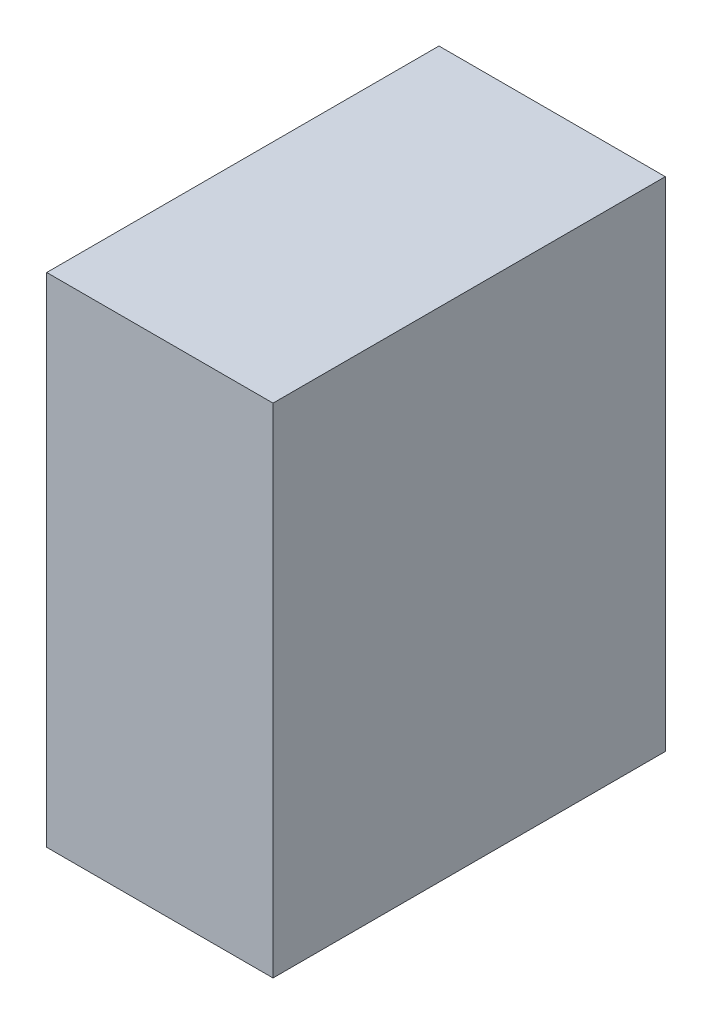
ISO-10303-21;
HEADER;
FILE_DESCRIPTION(('STEP AP214'),'2;1');
FILE_NAME('part.step','',(''),(''),'','','');
FILE_SCHEMA(('AUTOMOTIVE_DESIGN { 1 0 10303 214 1 1 1 1 }'));
ENDSEC;
DATA;
#1=APPLICATION_CONTEXT('core data for automotive mechanical design processes');
#2=APPLICATION_PROTOCOL_DEFINITION('international standard','automotive_design',2000,#1);
#3=PRODUCT_CONTEXT('',#1,'mechanical');
#4=PRODUCT('Part','Part','',(#3));
#5=PRODUCT_RELATED_PRODUCT_CATEGORY('part','',(#4));
#6=PRODUCT_DEFINITION_FORMATION('','',#4);
#7=PRODUCT_DEFINITION_CONTEXT('part definition',#1,'design');
#8=PRODUCT_DEFINITION('design','',#6,#7);
#9=PRODUCT_DEFINITION_SHAPE('','',#8);
#10=(LENGTH_UNIT() NAMED_UNIT(*) SI_UNIT(.MILLI.,.METRE.));
#11=(NAMED_UNIT(*) PLANE_ANGLE_UNIT() SI_UNIT($,.RADIAN.));
#12=(NAMED_UNIT(*) SI_UNIT($,.STERADIAN.) SOLID_ANGLE_UNIT());
#13=UNCERTAINTY_MEASURE_WITH_UNIT(LENGTH_MEASURE(1.E-05),#10,'distance_accuracy_value','');
#14=(GEOMETRIC_REPRESENTATION_CONTEXT(3) GLOBAL_UNCERTAINTY_ASSIGNED_CONTEXT((#13)) GLOBAL_UNIT_ASSIGNED_CONTEXT((#10,
#11,#12)) REPRESENTATION_CONTEXT('',''));
#15=CARTESIAN_POINT('',(0.,0.,0.));
#16=DIRECTION('',(0.,0.,1.));
#17=DIRECTION('',(1.,0.,0.));
#18=AXIS2_PLACEMENT_3D('',#15,#16,#17);
#19=CARTESIAN_POINT('',(0.07500111999998,-0.1649984,0.));
#20=DIRECTION('',(-1.,0.,0.));
#21=DIRECTION('',(0.,1.,0.));
#22=AXIS2_PLACEMENT_3D('',#19,#20,#21);
#23=PLANE('',#22);
#24=DIRECTION('',(0.,1.,0.));
#25=VECTOR('',#24,1.);
#26=CARTESIAN_POINT('',(0.07500111999998,-0.1649984,0.));
#27=LINE('',#26,#25);
#28=CARTESIAN_POINT('',(0.07500111999998,-0.1649984,0.));
#29=VERTEX_POINT('',#28);
#30=CARTESIAN_POINT('',(0.07500111999998,0.16500094,0.));
#31=VERTEX_POINT('',#30);
#32=EDGE_CURVE('E11',#29,#31,#27,.T.);
#33=ORIENTED_EDGE('',*,*,#32,.T.);
#34=DIRECTION('',(0.,0.,1.));
#35=VECTOR('',#34,1.);
#36=CARTESIAN_POINT('',(0.07500111999998,0.16500094,0.));
#37=LINE('',#36,#35);
#38=CARTESIAN_POINT('',(0.07500111999998,0.16500094,0.25999948));
#39=VERTEX_POINT('',#38);
#40=EDGE_CURVE('E24',#31,#39,#37,.T.);
#41=ORIENTED_EDGE('',*,*,#40,.T.);
#42=DIRECTION('',(0.,1.,0.));
#43=VECTOR('',#42,1.);
#44=CARTESIAN_POINT('',(0.07500111999998,-0.1649984,0.25999948));
#45=LINE('',#44,#43);
#46=CARTESIAN_POINT('',(0.07500111999998,-0.1649984,0.25999948));
#47=VERTEX_POINT('',#46);
#48=EDGE_CURVE('E87',#47,#39,#45,.T.);
#49=ORIENTED_EDGE('',*,*,#48,.F.);
#50=DIRECTION('',(0.,0.,1.));
#51=VECTOR('',#50,1.);
#52=CARTESIAN_POINT('',(0.07500111999998,-0.1649984,0.));
#53=LINE('',#52,#51);
#54=EDGE_CURVE('E36',#29,#47,#53,.T.);
#55=ORIENTED_EDGE('',*,*,#54,.F.);
#56=EDGE_LOOP('',(#33,#41,#49,#55));
#57=FACE_BOUND('',#56,.T.);
#58=ADVANCED_FACE('F17',(#57),#23,.F.);
#59=CARTESIAN_POINT('',(0.07500111999998,0.16500094,0.));
#60=DIRECTION('',(0.,-1.,0.));
#61=DIRECTION('',(-1.,0.,0.));
#62=AXIS2_PLACEMENT_3D('',#59,#60,#61);
#63=PLANE('',#62);
#64=DIRECTION('',(-1.,0.,0.));
#65=VECTOR('',#64,1.);
#66=CARTESIAN_POINT('',(0.07500111999998,0.16500094,0.));
#67=LINE('',#66,#65);
#68=CARTESIAN_POINT('',(-0.07499858000001,0.16500094,0.));
#69=VERTEX_POINT('',#68);
#70=EDGE_CURVE('E84',#31,#69,#67,.T.);
#71=ORIENTED_EDGE('',*,*,#70,.T.);
#72=DIRECTION('',(0.,0.,1.));
#73=VECTOR('',#72,1.);
#74=CARTESIAN_POINT('',(-0.07499858000001,0.16500094,0.));
#75=LINE('',#74,#73);
#76=CARTESIAN_POINT('',(-0.07499858000001,0.16500094,0.25999948));
#77=VERTEX_POINT('',#76);
#78=EDGE_CURVE('E82',#69,#77,#75,.T.);
#79=ORIENTED_EDGE('',*,*,#78,.T.);
#80=DIRECTION('',(-1.,0.,0.));
#81=VECTOR('',#80,1.);
#82=CARTESIAN_POINT('',(0.07500111999998,0.16500094,0.25999948));
#83=LINE('',#82,#81);
#84=EDGE_CURVE('E62',#39,#77,#83,.T.);
#85=ORIENTED_EDGE('',*,*,#84,.F.);
#86=ORIENTED_EDGE('',*,*,#40,.F.);
#87=EDGE_LOOP('',(#71,#79,#85,#86));
#88=FACE_BOUND('',#87,.T.);
#89=ADVANCED_FACE('F89',(#88),#63,.F.);
#90=CARTESIAN_POINT('',(-0.07499858000001,0.16500094,0.));
#91=DIRECTION('',(1.,0.,0.));
#92=DIRECTION('',(0.,-1.,0.));
#93=AXIS2_PLACEMENT_3D('',#90,#91,#92);
#94=PLANE('',#93);
#95=DIRECTION('',(0.,-1.,0.));
#96=VECTOR('',#95,1.);
#97=CARTESIAN_POINT('',(-0.07499858000001,0.16500094,0.));
#98=LINE('',#97,#96);
#99=CARTESIAN_POINT('',(-0.07499858000001,-0.1649984,0.));
#100=VERTEX_POINT('',#99);
#101=EDGE_CURVE('E71',#69,#100,#98,.T.);
#102=ORIENTED_EDGE('',*,*,#101,.T.);
#103=DIRECTION('',(0.,0.,1.));
#104=VECTOR('',#103,1.);
#105=CARTESIAN_POINT('',(-0.07499858000001,-0.1649984,0.));
#106=LINE('',#105,#104);
#107=CARTESIAN_POINT('',(-0.07499858000001,-0.1649984,0.25999948));
#108=VERTEX_POINT('',#107);
#109=EDGE_CURVE('E65',#100,#108,#106,.T.);
#110=ORIENTED_EDGE('',*,*,#109,.T.);
#111=DIRECTION('',(0.,-1.,0.));
#112=VECTOR('',#111,1.);
#113=CARTESIAN_POINT('',(-0.07499858000001,0.16500094,0.25999948));
#114=LINE('',#113,#112);
#115=EDGE_CURVE('E57',#77,#108,#114,.T.);
#116=ORIENTED_EDGE('',*,*,#115,.F.);
#117=ORIENTED_EDGE('',*,*,#78,.F.);
#118=EDGE_LOOP('',(#102,#110,#116,#117));
#119=FACE_BOUND('',#118,.T.);
#120=ADVANCED_FACE('F69',(#119),#94,.F.);
#121=CARTESIAN_POINT('',(-0.07499858000001,-0.1649984,0.));
#122=DIRECTION('',(0.,1.,0.));
#123=DIRECTION('',(1.,0.,0.));
#124=AXIS2_PLACEMENT_3D('',#121,#122,#123);
#125=PLANE('',#124);
#126=DIRECTION('',(1.,0.,0.));
#127=VECTOR('',#126,1.);
#128=CARTESIAN_POINT('',(-0.07499858000001,-0.1649984,0.));
#129=LINE('',#128,#127);
#130=EDGE_CURVE('E66',#100,#29,#129,.T.);
#131=ORIENTED_EDGE('',*,*,#130,.T.);
#132=ORIENTED_EDGE('',*,*,#54,.T.);
#133=DIRECTION('',(1.,0.,0.));
#134=VECTOR('',#133,1.);
#135=CARTESIAN_POINT('',(-0.07499858000001,-0.1649984,0.25999948));
#136=LINE('',#135,#134);
#137=EDGE_CURVE('E61',#108,#47,#136,.T.);
#138=ORIENTED_EDGE('',*,*,#137,.F.);
#139=ORIENTED_EDGE('',*,*,#109,.F.);
#140=EDGE_LOOP('',(#131,#132,#138,#139));
#141=FACE_BOUND('',#140,.T.);
#142=ADVANCED_FACE('F76',(#141),#125,.F.);
#143=CARTESIAN_POINT('',(1.269999984288E-06,1.270000002056E-06,0.));
#144=DIRECTION('',(0.,0.,1.));
#145=DIRECTION('',(1.,0.,0.));
#146=AXIS2_PLACEMENT_3D('',#143,#144,#145);
#147=PLANE('',#146);
#148=ORIENTED_EDGE('',*,*,#130,.F.);
#149=ORIENTED_EDGE('',*,*,#101,.F.);
#150=ORIENTED_EDGE('',*,*,#70,.F.);
#151=ORIENTED_EDGE('',*,*,#32,.F.);
#152=EDGE_LOOP('',(#148,#149,#150,#151));
#153=FACE_BOUND('',#152,.T.);
#154=ADVANCED_FACE('F91',(#153),#147,.F.);
#155=CARTESIAN_POINT('',(1.269999984288E-06,1.270000002056E-06,0.25999948));
#156=DIRECTION('',(0.,0.,1.));
#157=DIRECTION('',(1.,0.,0.));
#158=AXIS2_PLACEMENT_3D('',#155,#156,#157);
#159=PLANE('',#158);
#160=ORIENTED_EDGE('',*,*,#48,.T.);
#161=ORIENTED_EDGE('',*,*,#84,.T.);
#162=ORIENTED_EDGE('',*,*,#115,.T.);
#163=ORIENTED_EDGE('',*,*,#137,.T.);
#164=EDGE_LOOP('',(#160,#161,#162,#163));
#165=FACE_BOUND('',#164,.T.);
#166=ADVANCED_FACE('F59',(#165),#159,.T.);
#167=CLOSED_SHELL('',(#58,#89,#120,#142,#154,#166));
#168=MANIFOLD_SOLID_BREP('B1',#167);
#169=ADVANCED_BREP_SHAPE_REPRESENTATION('',(#18,#168),#14);
#170=SHAPE_DEFINITION_REPRESENTATION(#9,#169);
ENDSEC;
END-ISO-10303-21;
